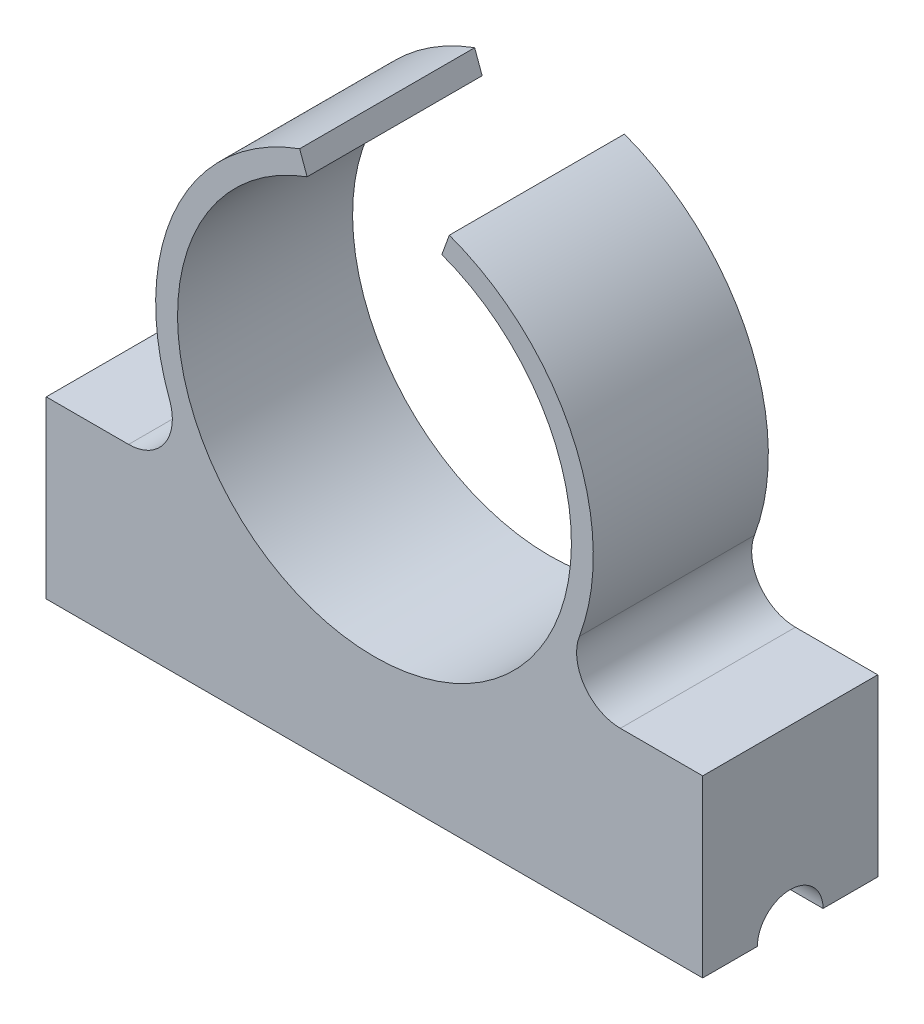
ISO-10303-21;
HEADER;
FILE_DESCRIPTION(('STEP AP214'),'2;1');
FILE_NAME('part.step','',(''),(''),'','','');
FILE_SCHEMA(('AUTOMOTIVE_DESIGN { 1 0 10303 214 1 1 1 1 }'));
ENDSEC;
DATA;
#1=APPLICATION_CONTEXT('core data for automotive mechanical design processes');
#2=APPLICATION_PROTOCOL_DEFINITION('international standard','automotive_design',2000,#1);
#3=PRODUCT_CONTEXT('',#1,'mechanical');
#4=PRODUCT('Part','Part','',(#3));
#5=PRODUCT_RELATED_PRODUCT_CATEGORY('part','',(#4));
#6=PRODUCT_DEFINITION_FORMATION('','',#4);
#7=PRODUCT_DEFINITION_CONTEXT('part definition',#1,'design');
#8=PRODUCT_DEFINITION('design','',#6,#7);
#9=PRODUCT_DEFINITION_SHAPE('','',#8);
#10=(LENGTH_UNIT() NAMED_UNIT(*) SI_UNIT(.MILLI.,.METRE.));
#11=(NAMED_UNIT(*) PLANE_ANGLE_UNIT() SI_UNIT($,.RADIAN.));
#12=(NAMED_UNIT(*) SI_UNIT($,.STERADIAN.) SOLID_ANGLE_UNIT());
#13=UNCERTAINTY_MEASURE_WITH_UNIT(LENGTH_MEASURE(1.E-05),#10,'distance_accuracy_value','');
#14=(GEOMETRIC_REPRESENTATION_CONTEXT(3) GLOBAL_UNCERTAINTY_ASSIGNED_CONTEXT((#13)) GLOBAL_UNIT_ASSIGNED_CONTEXT((#10,
#11,#12)) REPRESENTATION_CONTEXT('',''));
#15=CARTESIAN_POINT('',(0.,0.,0.));
#16=DIRECTION('',(0.,0.,1.));
#17=DIRECTION('',(1.,0.,0.));
#18=AXIS2_PLACEMENT_3D('',#15,#16,#17);
#19=CARTESIAN_POINT('',(-15.,-2.5,8.));
#20=DIRECTION('',(0.,1.,0.));
#21=DIRECTION('',(0.,0.,1.));
#22=AXIS2_PLACEMENT_3D('',#19,#20,#21);
#23=PLANE('',#22);
#24=DIRECTION('',(0.,0.,-1.));
#25=VECTOR('',#24,1.);
#26=CARTESIAN_POINT('',(-15.,-2.5,8.));
#27=LINE('',#26,#25);
#28=CARTESIAN_POINT('',(-15.,-2.5,8.));
#29=VERTEX_POINT('',#28);
#30=CARTESIAN_POINT('',(-15.,-2.5,5.5));
#31=VERTEX_POINT('',#30);
#32=EDGE_CURVE('E174',#29,#31,#27,.T.);
#33=ORIENTED_EDGE('',*,*,#32,.T.);
#34=DIRECTION('',(1.,0.,0.));
#35=VECTOR('',#34,1.);
#36=CARTESIAN_POINT('',(-95.,-2.5,5.5));
#37=LINE('',#36,#35);
#38=CARTESIAN_POINT('',(15.,-2.5,5.5));
#39=VERTEX_POINT('',#38);
#40=EDGE_CURVE('E182',#31,#39,#37,.T.);
#41=ORIENTED_EDGE('',*,*,#40,.T.);
#42=DIRECTION('',(0.,0.,-1.));
#43=VECTOR('',#42,1.);
#44=CARTESIAN_POINT('',(15.,-2.5,8.));
#45=LINE('',#44,#43);
#46=CARTESIAN_POINT('',(15.,-2.5,8.));
#47=VERTEX_POINT('',#46);
#48=EDGE_CURVE('E169',#47,#39,#45,.T.);
#49=ORIENTED_EDGE('',*,*,#48,.F.);
#50=DIRECTION('',(1.,0.,0.));
#51=VECTOR('',#50,1.);
#52=CARTESIAN_POINT('',(-15.,-2.5,8.));
#53=LINE('',#52,#51);
#54=EDGE_CURVE('E220',#29,#47,#53,.T.);
#55=ORIENTED_EDGE('',*,*,#54,.F.);
#56=EDGE_LOOP('',(#33,#41,#49,#55));
#57=FACE_BOUND('',#56,.T.);
#58=ADVANCED_FACE('F33',(#57),#23,.F.);
#59=CARTESIAN_POINT('',(0.,11.7123465704765,8.));
#60=DIRECTION('',(0.,0.,-1.));
#61=DIRECTION('',(-1.,0.,0.));
#62=AXIS2_PLACEMENT_3D('',#59,#60,#61);
#63=CYLINDRICAL_SURFACE('',#62,10.);
#64=CARTESIAN_POINT('',(0.,11.7123465704765,8.));
#65=DIRECTION('',(0.,0.,1.));
#66=DIRECTION('',(1.,0.,0.));
#67=AXIS2_PLACEMENT_3D('',#64,#65,#66);
#68=CIRCLE('',#67,10.);
#69=CARTESIAN_POINT('',(-3.42020143325666,21.1092727783356,8.));
#70=VERTEX_POINT('',#69);
#71=CARTESIAN_POINT('',(-9.36364632391154,8.20205776174608,8.));
#72=VERTEX_POINT('',#71);
#73=EDGE_CURVE('E146',#70,#72,#68,.T.);
#74=ORIENTED_EDGE('',*,*,#73,.F.);
#75=DIRECTION('',(0.,0.,-1.));
#76=VECTOR('',#75,1.);
#77=CARTESIAN_POINT('',(-3.42020143325666,21.1092727783356,30.));
#78=LINE('',#77,#76);
#79=CARTESIAN_POINT('',(-3.42020143325666,21.1092727783356,0.));
#80=VERTEX_POINT('',#79);
#81=EDGE_CURVE('E134',#70,#80,#78,.T.);
#82=ORIENTED_EDGE('',*,*,#81,.T.);
#83=CARTESIAN_POINT('',(0.,11.7123465704765,0.));
#84=DIRECTION('',(0.,0.,1.));
#85=DIRECTION('',(1.,0.,0.));
#86=AXIS2_PLACEMENT_3D('',#83,#84,#85);
#87=CIRCLE('',#86,10.);
#88=CARTESIAN_POINT('',(-9.36364632391154,8.20205776174608,0.));
#89=VERTEX_POINT('',#88);
#90=EDGE_CURVE('E144',#80,#89,#87,.T.);
#91=ORIENTED_EDGE('',*,*,#90,.T.);
#92=DIRECTION('',(0.,0.,-1.));
#93=VECTOR('',#92,1.);
#94=CARTESIAN_POINT('',(-9.36364632391154,8.20205776174608,8.));
#95=LINE('',#94,#93);
#96=EDGE_CURVE('E185',#89,#72,#95,.F.);
#97=ORIENTED_EDGE('',*,*,#96,.T.);
#98=EDGE_LOOP('',(#74,#82,#91,#97));
#99=FACE_BOUND('',#98,.T.);
#100=ADVANCED_FACE('F142',(#99),#63,.T.);
#101=CARTESIAN_POINT('',(15.,-2.5,8.));
#102=DIRECTION('',(-1.,0.,0.));
#103=DIRECTION('',(0.,0.,1.));
#104=AXIS2_PLACEMENT_3D('',#101,#102,#103);
#105=PLANE('',#104);
#106=ORIENTED_EDGE('',*,*,#48,.T.);
#107=CARTESIAN_POINT('',(15.,-2.5,4.));
#108=DIRECTION('',(1.,0.,0.));
#109=DIRECTION('',(0.,0.,-1.));
#110=AXIS2_PLACEMENT_3D('',#107,#108,#109);
#111=CIRCLE('',#110,1.5);
#112=CARTESIAN_POINT('',(15.,-2.5,2.5));
#113=VERTEX_POINT('',#112);
#114=EDGE_CURVE('E212',#113,#39,#111,.T.);
#115=ORIENTED_EDGE('',*,*,#114,.F.);
#116=CARTESIAN_POINT('',(15.,-2.5,0.));
#117=VERTEX_POINT('',#116);
#118=EDGE_CURVE('E173',#113,#117,#45,.T.);
#119=ORIENTED_EDGE('',*,*,#118,.T.);
#120=DIRECTION('',(0.,1.,0.));
#121=VECTOR('',#120,1.);
#122=CARTESIAN_POINT('',(15.,-2.5,0.));
#123=LINE('',#122,#121);
#124=CARTESIAN_POINT('',(15.,5.5,0.));
#125=VERTEX_POINT('',#124);
#126=EDGE_CURVE('E155',#117,#125,#123,.T.);
#127=ORIENTED_EDGE('',*,*,#126,.T.);
#128=DIRECTION('',(0.,0.,-1.));
#129=VECTOR('',#128,1.);
#130=CARTESIAN_POINT('',(15.,5.5,0.));
#131=LINE('',#130,#129);
#132=CARTESIAN_POINT('',(15.,5.5,8.));
#133=VERTEX_POINT('',#132);
#134=EDGE_CURVE('E244',#133,#125,#131,.T.);
#135=ORIENTED_EDGE('',*,*,#134,.F.);
#136=DIRECTION('',(0.,1.,0.));
#137=VECTOR('',#136,1.);
#138=CARTESIAN_POINT('',(15.,-2.5,8.));
#139=LINE('',#138,#137);
#140=EDGE_CURVE('E168',#47,#133,#139,.T.);
#141=ORIENTED_EDGE('',*,*,#140,.F.);
#142=EDGE_LOOP('',(#106,#115,#119,#127,#135,#141));
#143=FACE_BOUND('',#142,.T.);
#144=ADVANCED_FACE('F226',(#143),#105,.F.);
#145=CARTESIAN_POINT('',(9.36364632391154,8.20205776174608,0.));
#146=VERTEX_POINT('',#145);
#147=CARTESIAN_POINT('',(3.42020143325666,21.1092727783356,0.));
#148=VERTEX_POINT('',#147);
#149=EDGE_CURVE('E154',#146,#148,#87,.T.);
#150=ORIENTED_EDGE('',*,*,#149,.T.);
#151=DIRECTION('',(0.,0.,-1.));
#152=VECTOR('',#151,1.);
#153=CARTESIAN_POINT('',(3.42020143325666,21.1092727783356,30.));
#154=LINE('',#153,#152);
#155=CARTESIAN_POINT('',(3.42020143325666,21.1092727783356,8.));
#156=VERTEX_POINT('',#155);
#157=EDGE_CURVE('E147',#156,#148,#154,.T.);
#158=ORIENTED_EDGE('',*,*,#157,.F.);
#159=CARTESIAN_POINT('',(9.36364632391154,8.20205776174608,8.));
#160=VERTEX_POINT('',#159);
#161=EDGE_CURVE('E217',#160,#156,#68,.T.);
#162=ORIENTED_EDGE('',*,*,#161,.F.);
#163=DIRECTION('',(0.,0.,-1.));
#164=VECTOR('',#163,1.);
#165=CARTESIAN_POINT('',(9.36364632391154,8.20205776174608,8.));
#166=LINE('',#165,#164);
#167=EDGE_CURVE('E189',#160,#146,#166,.T.);
#168=ORIENTED_EDGE('',*,*,#167,.T.);
#169=EDGE_LOOP('',(#150,#158,#162,#168));
#170=FACE_BOUND('',#169,.T.);
#171=ADVANCED_FACE('F266',(#170),#63,.T.);
#172=CARTESIAN_POINT('',(-15.,-2.5,8.));
#173=DIRECTION('',(1.,0.,0.));
#174=DIRECTION('',(0.,0.,-1.));
#175=AXIS2_PLACEMENT_3D('',#172,#173,#174);
#176=PLANE('',#175);
#177=CARTESIAN_POINT('',(-15.,-2.5,2.5));
#178=VERTEX_POINT('',#177);
#179=CARTESIAN_POINT('',(-15.,-2.5,0.));
#180=VERTEX_POINT('',#179);
#181=EDGE_CURVE('E172',#178,#180,#27,.T.);
#182=ORIENTED_EDGE('',*,*,#181,.F.);
#183=CARTESIAN_POINT('',(-15.,-2.5,4.));
#184=DIRECTION('',(1.,0.,0.));
#185=DIRECTION('',(0.,0.,-1.));
#186=AXIS2_PLACEMENT_3D('',#183,#184,#185);
#187=CIRCLE('',#186,1.5);
#188=EDGE_CURVE('E209',#178,#31,#187,.T.);
#189=ORIENTED_EDGE('',*,*,#188,.T.);
#190=ORIENTED_EDGE('',*,*,#32,.F.);
#191=DIRECTION('',(0.,-1.,0.));
#192=VECTOR('',#191,1.);
#193=CARTESIAN_POINT('',(-15.,-2.5,8.));
#194=LINE('',#193,#192);
#195=CARTESIAN_POINT('',(-15.,5.5,8.));
#196=VERTEX_POINT('',#195);
#197=EDGE_CURVE('E219',#196,#29,#194,.T.);
#198=ORIENTED_EDGE('',*,*,#197,.F.);
#199=DIRECTION('',(0.,0.,-1.));
#200=VECTOR('',#199,1.);
#201=CARTESIAN_POINT('',(-15.,5.5,0.));
#202=LINE('',#201,#200);
#203=CARTESIAN_POINT('',(-15.,5.5,0.));
#204=VERTEX_POINT('',#203);
#205=EDGE_CURVE('E250',#196,#204,#202,.T.);
#206=ORIENTED_EDGE('',*,*,#205,.T.);
#207=DIRECTION('',(0.,-1.,0.));
#208=VECTOR('',#207,1.);
#209=CARTESIAN_POINT('',(-15.,-2.5,0.));
#210=LINE('',#209,#208);
#211=EDGE_CURVE('E158',#204,#180,#210,.T.);
#212=ORIENTED_EDGE('',*,*,#211,.T.);
#213=EDGE_LOOP('',(#182,#189,#190,#198,#206,#212));
#214=FACE_BOUND('',#213,.T.);
#215=ADVANCED_FACE('F287',(#214),#176,.F.);
#216=ORIENTED_EDGE('',*,*,#118,.F.);
#217=DIRECTION('',(1.,0.,0.));
#218=VECTOR('',#217,1.);
#219=CARTESIAN_POINT('',(-95.,-2.5,2.5));
#220=LINE('',#219,#218);
#221=EDGE_CURVE('E177',#113,#178,#220,.F.);
#222=ORIENTED_EDGE('',*,*,#221,.T.);
#223=ORIENTED_EDGE('',*,*,#181,.T.);
#224=DIRECTION('',(1.,0.,0.));
#225=VECTOR('',#224,1.);
#226=CARTESIAN_POINT('',(-15.,-2.5,0.));
#227=LINE('',#226,#225);
#228=EDGE_CURVE('E165',#180,#117,#227,.T.);
#229=ORIENTED_EDGE('',*,*,#228,.T.);
#230=EDGE_LOOP('',(#216,#222,#223,#229));
#231=FACE_BOUND('',#230,.T.);
#232=ADVANCED_FACE('F232',(#231),#23,.F.);
#233=CARTESIAN_POINT('',(0.,11.7123465704765,8.));
#234=DIRECTION('',(0.,0.,1.));
#235=DIRECTION('',(1.,0.,0.));
#236=AXIS2_PLACEMENT_3D('',#233,#234,#235);
#237=PLANE('',#236);
#238=DIRECTION('',(0.342020143325666,0.93969262078591,0.));
#239=VECTOR('',#238,1.);
#240=CARTESIAN_POINT('',(0.,11.7123465704765,8.));
#241=LINE('',#240,#239);
#242=CARTESIAN_POINT('',(3.07818128993099,20.1695801575497,8.));
#243=VERTEX_POINT('',#242);
#244=EDGE_CURVE('E208',#243,#156,#241,.T.);
#245=ORIENTED_EDGE('',*,*,#244,.F.);
#246=CARTESIAN_POINT('',(0.,11.7123465704765,8.));
#247=DIRECTION('',(0.,0.,1.));
#248=DIRECTION('',(1.,0.,0.));
#249=AXIS2_PLACEMENT_3D('',#246,#247,#248);
#250=CIRCLE('',#249,9.);
#251=CARTESIAN_POINT('',(-3.07818128993099,20.1695801575497,8.));
#252=VERTEX_POINT('',#251);
#253=EDGE_CURVE('E179',#252,#243,#250,.T.);
#254=ORIENTED_EDGE('',*,*,#253,.F.);
#255=DIRECTION('',(0.342020143325666,-0.93969262078591,0.));
#256=VECTOR('',#255,1.);
#257=CARTESIAN_POINT('',(0.,11.7123465704765,8.));
#258=LINE('',#257,#256);
#259=EDGE_CURVE('E48',#70,#252,#258,.T.);
#260=ORIENTED_EDGE('',*,*,#259,.F.);
#261=ORIENTED_EDGE('',*,*,#73,.T.);
#262=CARTESIAN_POINT('',(-11.2363755886938,7.5,8.));
#263=DIRECTION('',(0.,0.,1.));
#264=DIRECTION('',(1.,0.,0.));
#265=AXIS2_PLACEMENT_3D('',#262,#263,#264);
#266=CIRCLE('',#265,2.);
#267=CARTESIAN_POINT('',(-11.2363755886938,5.5,8.));
#268=VERTEX_POINT('',#267);
#269=EDGE_CURVE('E194',#72,#268,#266,.F.);
#270=ORIENTED_EDGE('',*,*,#269,.T.);
#271=DIRECTION('',(-1.,0.,0.));
#272=VECTOR('',#271,1.);
#273=CARTESIAN_POINT('',(15.,5.5,8.));
#274=LINE('',#273,#272);
#275=EDGE_CURVE('E249',#268,#196,#274,.T.);
#276=ORIENTED_EDGE('',*,*,#275,.T.);
#277=ORIENTED_EDGE('',*,*,#197,.T.);
#278=ORIENTED_EDGE('',*,*,#54,.T.);
#279=ORIENTED_EDGE('',*,*,#140,.T.);
#280=CARTESIAN_POINT('',(11.2363755886938,5.5,8.));
#281=VERTEX_POINT('',#280);
#282=EDGE_CURVE('E247',#133,#281,#274,.T.);
#283=ORIENTED_EDGE('',*,*,#282,.T.);
#284=CARTESIAN_POINT('',(11.2363755886938,7.5,8.));
#285=DIRECTION('',(0.,0.,1.));
#286=DIRECTION('',(1.,0.,0.));
#287=AXIS2_PLACEMENT_3D('',#284,#285,#286);
#288=CIRCLE('',#287,2.);
#289=EDGE_CURVE('E199',#281,#160,#288,.F.);
#290=ORIENTED_EDGE('',*,*,#289,.T.);
#291=ORIENTED_EDGE('',*,*,#161,.T.);
#292=EDGE_LOOP('',(#245,#254,#260,#261,#270,#276,#277,#278,#279,#283,#290,#291));
#293=FACE_BOUND('',#292,.T.);
#294=ADVANCED_FACE('F206',(#293),#237,.T.);
#295=CARTESIAN_POINT('',(0.,11.7123465704765,0.));
#296=DIRECTION('',(0.,0.,1.));
#297=DIRECTION('',(1.,0.,0.));
#298=AXIS2_PLACEMENT_3D('',#295,#296,#297);
#299=PLANE('',#298);
#300=CARTESIAN_POINT('',(0.,11.7123465704765,0.));
#301=DIRECTION('',(0.,0.,1.));
#302=DIRECTION('',(1.,0.,0.));
#303=AXIS2_PLACEMENT_3D('',#300,#301,#302);
#304=CIRCLE('',#303,9.);
#305=CARTESIAN_POINT('',(-3.07818128993099,20.1695801575497,0.));
#306=VERTEX_POINT('',#305);
#307=CARTESIAN_POINT('',(3.07818128993099,20.1695801575497,0.));
#308=VERTEX_POINT('',#307);
#309=EDGE_CURVE('E159',#306,#308,#304,.T.);
#310=ORIENTED_EDGE('',*,*,#309,.T.);
#311=DIRECTION('',(-0.342020143325666,-0.93969262078591,0.));
#312=VECTOR('',#311,1.);
#313=CARTESIAN_POINT('',(0.,11.7123465704765,0.));
#314=LINE('',#313,#312);
#315=EDGE_CURVE('E56',#148,#308,#314,.T.);
#316=ORIENTED_EDGE('',*,*,#315,.F.);
#317=ORIENTED_EDGE('',*,*,#149,.F.);
#318=CARTESIAN_POINT('',(11.2363755886938,7.5,0.));
#319=DIRECTION('',(0.,0.,1.));
#320=DIRECTION('',(1.,0.,0.));
#321=AXIS2_PLACEMENT_3D('',#318,#319,#320);
#322=CIRCLE('',#321,2.);
#323=CARTESIAN_POINT('',(11.2363755886938,5.5,0.));
#324=VERTEX_POINT('',#323);
#325=EDGE_CURVE('E197',#146,#324,#322,.T.);
#326=ORIENTED_EDGE('',*,*,#325,.T.);
#327=DIRECTION('',(-1.,0.,0.));
#328=VECTOR('',#327,1.);
#329=CARTESIAN_POINT('',(15.,5.5,0.));
#330=LINE('',#329,#328);
#331=EDGE_CURVE('E236',#125,#324,#330,.T.);
#332=ORIENTED_EDGE('',*,*,#331,.F.);
#333=ORIENTED_EDGE('',*,*,#126,.F.);
#334=ORIENTED_EDGE('',*,*,#228,.F.);
#335=ORIENTED_EDGE('',*,*,#211,.F.);
#336=CARTESIAN_POINT('',(-11.2363755886938,5.5,0.));
#337=VERTEX_POINT('',#336);
#338=EDGE_CURVE('E241',#337,#204,#330,.T.);
#339=ORIENTED_EDGE('',*,*,#338,.F.);
#340=CARTESIAN_POINT('',(-11.2363755886938,7.5,0.));
#341=DIRECTION('',(0.,0.,1.));
#342=DIRECTION('',(1.,0.,0.));
#343=AXIS2_PLACEMENT_3D('',#340,#341,#342);
#344=CIRCLE('',#343,2.);
#345=EDGE_CURVE('E152',#337,#89,#344,.T.);
#346=ORIENTED_EDGE('',*,*,#345,.T.);
#347=ORIENTED_EDGE('',*,*,#90,.F.);
#348=DIRECTION('',(-0.342020143325666,0.93969262078591,0.));
#349=VECTOR('',#348,1.);
#350=CARTESIAN_POINT('',(0.,11.7123465704765,0.));
#351=LINE('',#350,#349);
#352=EDGE_CURVE('E131',#306,#80,#351,.T.);
#353=ORIENTED_EDGE('',*,*,#352,.F.);
#354=EDGE_LOOP('',(#310,#316,#317,#326,#332,#333,#334,#335,#339,#346,#347,#353));
#355=FACE_BOUND('',#354,.T.);
#356=ADVANCED_FACE('F149',(#355),#299,.F.);
#357=CARTESIAN_POINT('',(0.,11.7123465704765,-27.));
#358=DIRECTION('',(0.,0.,1.));
#359=DIRECTION('',(1.,0.,0.));
#360=AXIS2_PLACEMENT_3D('',#357,#358,#359);
#361=CYLINDRICAL_SURFACE('',#360,9.);
#362=ORIENTED_EDGE('',*,*,#253,.T.);
#363=DIRECTION('',(0.,0.,1.));
#364=VECTOR('',#363,1.);
#365=CARTESIAN_POINT('',(3.07818128993099,20.1695801575497,-27.));
#366=LINE('',#365,#364);
#367=EDGE_CURVE('E11',#243,#308,#366,.F.);
#368=ORIENTED_EDGE('',*,*,#367,.T.);
#369=ORIENTED_EDGE('',*,*,#309,.F.);
#370=DIRECTION('',(0.,0.,1.));
#371=VECTOR('',#370,1.);
#372=CARTESIAN_POINT('',(-3.07818128993099,20.1695801575497,-27.));
#373=LINE('',#372,#371);
#374=EDGE_CURVE('E41',#306,#252,#373,.T.);
#375=ORIENTED_EDGE('',*,*,#374,.T.);
#376=EDGE_LOOP('',(#362,#368,#369,#375));
#377=FACE_BOUND('',#376,.T.);
#378=ADVANCED_FACE('F203',(#377),#361,.F.);
#379=CARTESIAN_POINT('',(-95.,-2.5,4.));
#380=DIRECTION('',(1.,0.,0.));
#381=DIRECTION('',(0.,0.,-1.));
#382=AXIS2_PLACEMENT_3D('',#379,#380,#381);
#383=CYLINDRICAL_SURFACE('',#382,1.5);
#384=ORIENTED_EDGE('',*,*,#188,.F.);
#385=ORIENTED_EDGE('',*,*,#221,.F.);
#386=ORIENTED_EDGE('',*,*,#114,.T.);
#387=ORIENTED_EDGE('',*,*,#40,.F.);
#388=EDGE_LOOP('',(#384,#385,#386,#387));
#389=FACE_BOUND('',#388,.T.);
#390=ADVANCED_FACE('F258',(#389),#383,.F.);
#391=CARTESIAN_POINT('',(15.,5.5,0.));
#392=DIRECTION('',(0.,1.,0.));
#393=DIRECTION('',(0.,0.,1.));
#394=AXIS2_PLACEMENT_3D('',#391,#392,#393);
#395=PLANE('',#394);
#396=ORIENTED_EDGE('',*,*,#275,.F.);
#397=DIRECTION('',(0.,0.,-1.));
#398=VECTOR('',#397,1.);
#399=CARTESIAN_POINT('',(-11.2363755886938,5.5,0.));
#400=LINE('',#399,#398);
#401=EDGE_CURVE('E187',#268,#337,#400,.T.);
#402=ORIENTED_EDGE('',*,*,#401,.T.);
#403=ORIENTED_EDGE('',*,*,#338,.T.);
#404=ORIENTED_EDGE('',*,*,#205,.F.);
#405=EDGE_LOOP('',(#396,#402,#403,#404));
#406=FACE_BOUND('',#405,.T.);
#407=ADVANCED_FACE('F306',(#406),#395,.T.);
#408=ORIENTED_EDGE('',*,*,#331,.T.);
#409=DIRECTION('',(0.,0.,-1.));
#410=VECTOR('',#409,1.);
#411=CARTESIAN_POINT('',(11.2363755886938,5.5,0.));
#412=LINE('',#411,#410);
#413=EDGE_CURVE('E192',#324,#281,#412,.F.);
#414=ORIENTED_EDGE('',*,*,#413,.T.);
#415=ORIENTED_EDGE('',*,*,#282,.F.);
#416=ORIENTED_EDGE('',*,*,#134,.T.);
#417=EDGE_LOOP('',(#408,#414,#415,#416));
#418=FACE_BOUND('',#417,.T.);
#419=ADVANCED_FACE('F245',(#418),#395,.T.);
#420=CARTESIAN_POINT('',(-11.2363755886938,7.5,8.));
#421=DIRECTION('',(0.,0.,-1.));
#422=DIRECTION('',(-1.,0.,0.));
#423=AXIS2_PLACEMENT_3D('',#420,#421,#422);
#424=CYLINDRICAL_SURFACE('',#423,2.);
#425=ORIENTED_EDGE('',*,*,#345,.F.);
#426=ORIENTED_EDGE('',*,*,#401,.F.);
#427=ORIENTED_EDGE('',*,*,#269,.F.);
#428=ORIENTED_EDGE('',*,*,#96,.F.);
#429=EDGE_LOOP('',(#425,#426,#427,#428));
#430=FACE_BOUND('',#429,.T.);
#431=ADVANCED_FACE('F299',(#430),#424,.F.);
#432=CARTESIAN_POINT('',(11.2363755886938,7.5,8.));
#433=DIRECTION('',(0.,0.,-1.));
#434=DIRECTION('',(-1.,0.,0.));
#435=AXIS2_PLACEMENT_3D('',#432,#433,#434);
#436=CYLINDRICAL_SURFACE('',#435,2.);
#437=ORIENTED_EDGE('',*,*,#289,.F.);
#438=ORIENTED_EDGE('',*,*,#413,.F.);
#439=ORIENTED_EDGE('',*,*,#325,.F.);
#440=ORIENTED_EDGE('',*,*,#167,.F.);
#441=EDGE_LOOP('',(#437,#438,#439,#440));
#442=FACE_BOUND('',#441,.T.);
#443=ADVANCED_FACE('F35',(#442),#436,.F.);
#444=CARTESIAN_POINT('',(0.,11.7123465704765,30.));
#445=DIRECTION('',(-0.93969262078591,-0.342020143325666,0.));
#446=DIRECTION('',(0.342020143325666,-0.93969262078591,0.));
#447=AXIS2_PLACEMENT_3D('',#444,#445,#446);
#448=PLANE('',#447);
#449=ORIENTED_EDGE('',*,*,#259,.T.);
#450=ORIENTED_EDGE('',*,*,#374,.F.);
#451=ORIENTED_EDGE('',*,*,#352,.T.);
#452=ORIENTED_EDGE('',*,*,#81,.F.);
#453=EDGE_LOOP('',(#449,#450,#451,#452));
#454=FACE_BOUND('',#453,.T.);
#455=ADVANCED_FACE('F133',(#454),#448,.F.);
#456=CARTESIAN_POINT('',(0.,11.7123465704765,30.));
#457=DIRECTION('',(0.93969262078591,-0.342020143325666,0.));
#458=DIRECTION('',(0.342020143325666,0.93969262078591,0.));
#459=AXIS2_PLACEMENT_3D('',#456,#457,#458);
#460=PLANE('',#459);
#461=ORIENTED_EDGE('',*,*,#244,.T.);
#462=ORIENTED_EDGE('',*,*,#157,.T.);
#463=ORIENTED_EDGE('',*,*,#315,.T.);
#464=ORIENTED_EDGE('',*,*,#367,.F.);
#465=EDGE_LOOP('',(#461,#462,#463,#464));
#466=FACE_BOUND('',#465,.T.);
#467=ADVANCED_FACE('F270',(#466),#460,.F.);
#468=CLOSED_SHELL('',(#58,#100,#144,#171,#215,#232,#294,#356,#378,#390,#407,#419,#431,#443,#455,#467));
#469=MANIFOLD_SOLID_BREP('B2',#468);
#470=ADVANCED_BREP_SHAPE_REPRESENTATION('',(#18,#469),#14);
#471=SHAPE_DEFINITION_REPRESENTATION(#9,#470);
ENDSEC;
END-ISO-10303-21;
